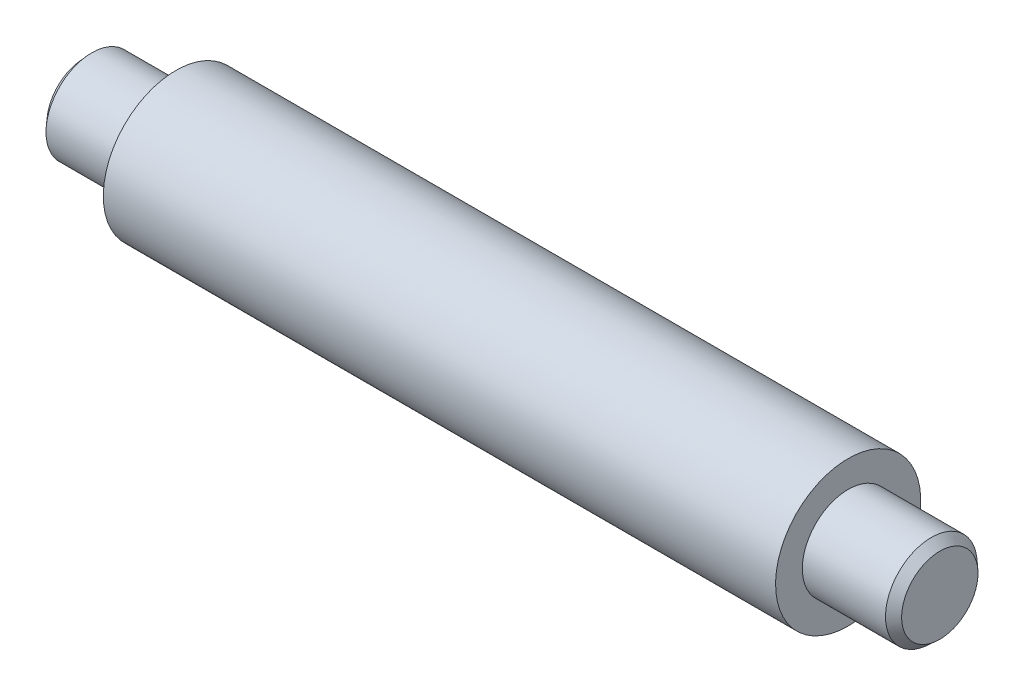
ISO-10303-21;
HEADER;
FILE_DESCRIPTION(('STEP AP214'),'2;1');
FILE_NAME('part.step','',(''),(''),'','','');
FILE_SCHEMA(('AUTOMOTIVE_DESIGN { 1 0 10303 214 1 1 1 1 }'));
ENDSEC;
DATA;
#1=APPLICATION_CONTEXT('core data for automotive mechanical design processes');
#2=APPLICATION_PROTOCOL_DEFINITION('international standard','automotive_design',2000,#1);
#3=PRODUCT_CONTEXT('',#1,'mechanical');
#4=PRODUCT('Part','Part','',(#3));
#5=PRODUCT_RELATED_PRODUCT_CATEGORY('part','',(#4));
#6=PRODUCT_DEFINITION_FORMATION('','',#4);
#7=PRODUCT_DEFINITION_CONTEXT('part definition',#1,'design');
#8=PRODUCT_DEFINITION('design','',#6,#7);
#9=PRODUCT_DEFINITION_SHAPE('','',#8);
#10=(LENGTH_UNIT() NAMED_UNIT(*) SI_UNIT(.MILLI.,.METRE.));
#11=(NAMED_UNIT(*) PLANE_ANGLE_UNIT() SI_UNIT($,.RADIAN.));
#12=(NAMED_UNIT(*) SI_UNIT($,.STERADIAN.) SOLID_ANGLE_UNIT());
#13=UNCERTAINTY_MEASURE_WITH_UNIT(LENGTH_MEASURE(1.E-05),#10,'distance_accuracy_value','');
#14=(GEOMETRIC_REPRESENTATION_CONTEXT(3) GLOBAL_UNCERTAINTY_ASSIGNED_CONTEXT((#13)) GLOBAL_UNIT_ASSIGNED_CONTEXT((#10,
#11,#12)) REPRESENTATION_CONTEXT('',''));
#15=CARTESIAN_POINT('',(0.,0.,0.));
#16=DIRECTION('',(0.,0.,1.));
#17=DIRECTION('',(1.,0.,0.));
#18=AXIS2_PLACEMENT_3D('',#15,#16,#17);
#19=CARTESIAN_POINT('',(60.,60.,0.));
#20=DIRECTION('',(1.,0.,0.));
#21=DIRECTION('',(0.,1.,0.));
#22=AXIS2_PLACEMENT_3D('',#19,#20,#21);
#23=PLANE('',#22);
#24=CARTESIAN_POINT('',(60.,30.,0.));
#25=DIRECTION('',(-1.,0.,0.));
#26=DIRECTION('',(0.,-1.,0.));
#27=AXIS2_PLACEMENT_3D('',#24,#25,#26);
#28=CIRCLE('',#27,30.);
#29=CARTESIAN_POINT('',(60.,0.,0.));
#30=VERTEX_POINT('',#29);
#31=EDGE_CURVE('E60',#30,#30,#28,.T.);
#32=ORIENTED_EDGE('',*,*,#31,.F.);
#33=EDGE_LOOP('',(#32));
#34=FACE_BOUND('',#33,.T.);
#35=CARTESIAN_POINT('',(60.,30.,0.));
#36=DIRECTION('',(-1.,0.,0.));
#37=DIRECTION('',(0.,-1.,0.));
#38=AXIS2_PLACEMENT_3D('',#35,#36,#37);
#39=CIRCLE('',#38,47.5);
#40=CARTESIAN_POINT('',(60.,-17.5,0.));
#41=VERTEX_POINT('',#40);
#42=EDGE_CURVE('E51',#41,#41,#39,.T.);
#43=ORIENTED_EDGE('',*,*,#42,.T.);
#44=EDGE_LOOP('',(#43));
#45=FACE_BOUND('',#44,.T.);
#46=ADVANCED_FACE('F31',(#34,#45),#23,.F.);
#47=CARTESIAN_POINT('',(0.,30.,0.));
#48=DIRECTION('',(-1.,0.,0.));
#49=DIRECTION('',(0.,-1.,0.));
#50=AXIS2_PLACEMENT_3D('',#47,#48,#49);
#51=CYLINDRICAL_SURFACE('',#50,47.4999999999999);
#52=ORIENTED_EDGE('',*,*,#42,.F.);
#53=EDGE_LOOP('',(#52));
#54=FACE_BOUND('',#53,.T.);
#55=CARTESIAN_POINT('',(500.,30.0000000000002,0.));
#56=DIRECTION('',(-1.,0.,0.));
#57=DIRECTION('',(0.,-1.,0.));
#58=AXIS2_PLACEMENT_3D('',#55,#56,#57);
#59=CIRCLE('',#58,47.4999999999998);
#60=CARTESIAN_POINT('',(500.,-17.4999999999996,0.));
#61=VERTEX_POINT('',#60);
#62=EDGE_CURVE('E54',#61,#61,#59,.T.);
#63=ORIENTED_EDGE('',*,*,#62,.T.);
#64=EDGE_LOOP('',(#63));
#65=FACE_BOUND('',#64,.T.);
#66=ADVANCED_FACE('F68',(#54,#65),#51,.T.);
#67=CARTESIAN_POINT('',(500.,60.0000000000002,0.));
#68=DIRECTION('',(-1.,0.,0.));
#69=DIRECTION('',(0.,-1.,0.));
#70=AXIS2_PLACEMENT_3D('',#67,#68,#69);
#71=PLANE('',#70);
#72=ORIENTED_EDGE('',*,*,#62,.F.);
#73=EDGE_LOOP('',(#72));
#74=FACE_BOUND('',#73,.T.);
#75=CARTESIAN_POINT('',(500.,30.0000000000002,0.));
#76=DIRECTION('',(-1.,0.,0.));
#77=DIRECTION('',(0.,-1.,0.));
#78=AXIS2_PLACEMENT_3D('',#75,#76,#77);
#79=CIRCLE('',#78,30.);
#80=CARTESIAN_POINT('',(500.,1.59594559789866E-13,0.));
#81=VERTEX_POINT('',#80);
#82=EDGE_CURVE('E57',#81,#81,#79,.T.);
#83=ORIENTED_EDGE('',*,*,#82,.T.);
#84=EDGE_LOOP('',(#83));
#85=FACE_BOUND('',#84,.T.);
#86=ADVANCED_FACE('F74',(#74,#85),#71,.F.);
#87=CARTESIAN_POINT('',(0.,30.,0.));
#88=DIRECTION('',(-1.,0.,0.));
#89=DIRECTION('',(0.,-1.,0.));
#90=AXIS2_PLACEMENT_3D('',#87,#88,#89);
#91=CYLINDRICAL_SURFACE('',#90,30.);
#92=CARTESIAN_POINT('',(554.446937425854,30.0000000000002,0.));
#93=DIRECTION('',(-1.,0.,0.));
#94=DIRECTION('',(0.,-1.,0.));
#95=AXIS2_PLACEMENT_3D('',#92,#93,#94);
#96=CIRCLE('',#95,30.);
#97=CARTESIAN_POINT('',(554.446937425854,1.80411241501588E-13,0.));
#98=VERTEX_POINT('',#97);
#99=EDGE_CURVE('E46',#98,#98,#96,.T.);
#100=ORIENTED_EDGE('',*,*,#99,.T.);
#101=EDGE_LOOP('',(#100));
#102=FACE_BOUND('',#101,.T.);
#103=ORIENTED_EDGE('',*,*,#82,.F.);
#104=EDGE_LOOP('',(#103));
#105=FACE_BOUND('',#104,.T.);
#106=ADVANCED_FACE('F80',(#102,#105),#91,.T.);
#107=CARTESIAN_POINT('',(560.,30.0000000000002,0.));
#108=DIRECTION('',(-1.,0.,0.));
#109=DIRECTION('',(0.,-1.,0.));
#110=AXIS2_PLACEMENT_3D('',#107,#108,#109);
#111=PLANE('',#110);
#112=CARTESIAN_POINT('',(560.,30.0000000000002,0.));
#113=DIRECTION('',(-1.,0.,0.));
#114=DIRECTION('',(0.,-1.,0.));
#115=AXIS2_PLACEMENT_3D('',#112,#113,#114);
#116=CIRCLE('',#115,24.9999999999999);
#117=CARTESIAN_POINT('',(560.,5.00000000000028,0.));
#118=VERTEX_POINT('',#117);
#119=EDGE_CURVE('E42',#118,#118,#116,.F.);
#120=ORIENTED_EDGE('',*,*,#119,.T.);
#121=EDGE_LOOP('',(#120));
#122=FACE_BOUND('',#121,.T.);
#123=ADVANCED_FACE('F85',(#122),#111,.F.);
#124=CARTESIAN_POINT('',(0.,30.,0.));
#125=DIRECTION('',(1.,0.,0.));
#126=DIRECTION('',(0.,1.,0.));
#127=AXIS2_PLACEMENT_3D('',#124,#125,#126);
#128=PLANE('',#127);
#129=CARTESIAN_POINT('',(0.,30.,0.));
#130=DIRECTION('',(1.,0.,0.));
#131=DIRECTION('',(0.,1.,0.));
#132=AXIS2_PLACEMENT_3D('',#129,#130,#131);
#133=CIRCLE('',#132,24.4469374258539);
#134=CARTESIAN_POINT('',(0.,54.4469374258539,0.));
#135=VERTEX_POINT('',#134);
#136=EDGE_CURVE('E38',#135,#135,#133,.F.);
#137=ORIENTED_EDGE('',*,*,#136,.T.);
#138=EDGE_LOOP('',(#137));
#139=FACE_BOUND('',#138,.T.);
#140=ADVANCED_FACE('F91',(#139),#128,.F.);
#141=CARTESIAN_POINT('',(0.,30.,0.));
#142=DIRECTION('',(-1.,0.,0.));
#143=DIRECTION('',(0.,-1.,0.));
#144=AXIS2_PLACEMENT_3D('',#141,#142,#143);
#145=CYLINDRICAL_SURFACE('',#144,30.);
#146=CARTESIAN_POINT('',(5.0000000000001,30.,0.));
#147=DIRECTION('',(1.,0.,0.));
#148=DIRECTION('',(0.,1.,0.));
#149=AXIS2_PLACEMENT_3D('',#146,#147,#148);
#150=CIRCLE('',#149,30.);
#151=CARTESIAN_POINT('',(5.00000000000008,60.,0.));
#152=VERTEX_POINT('',#151);
#153=EDGE_CURVE('E10',#152,#152,#150,.T.);
#154=ORIENTED_EDGE('',*,*,#153,.T.);
#155=EDGE_LOOP('',(#154));
#156=FACE_BOUND('',#155,.T.);
#157=ORIENTED_EDGE('',*,*,#31,.T.);
#158=EDGE_LOOP('',(#157));
#159=FACE_BOUND('',#158,.T.);
#160=ADVANCED_FACE('F64',(#156,#159),#145,.T.);
#161=CARTESIAN_POINT('',(554.446937425854,30.0000000000002,0.));
#162=DIRECTION('',(-1.,0.,0.));
#163=DIRECTION('',(0.,-1.,0.));
#164=AXIS2_PLACEMENT_3D('',#161,#162,#163);
#165=CONICAL_SURFACE('',#164,30.,0.733038285837615);
#166=ORIENTED_EDGE('',*,*,#119,.F.);
#167=EDGE_LOOP('',(#166));
#168=FACE_BOUND('',#167,.T.);
#169=ORIENTED_EDGE('',*,*,#99,.F.);
#170=EDGE_LOOP('',(#169));
#171=FACE_BOUND('',#170,.T.);
#172=ADVANCED_FACE('F95',(#168,#171),#165,.T.);
#173=CARTESIAN_POINT('',(0.,30.,0.));
#174=DIRECTION('',(1.,0.,0.));
#175=DIRECTION('',(0.,1.,0.));
#176=AXIS2_PLACEMENT_3D('',#173,#174,#175);
#177=CONICAL_SURFACE('',#176,24.4469374258539,0.837758040957279);
#178=ORIENTED_EDGE('',*,*,#153,.F.);
#179=EDGE_LOOP('',(#178));
#180=FACE_BOUND('',#179,.T.);
#181=ORIENTED_EDGE('',*,*,#136,.F.);
#182=EDGE_LOOP('',(#181));
#183=FACE_BOUND('',#182,.T.);
#184=ADVANCED_FACE('F33',(#180,#183),#177,.T.);
#185=CLOSED_SHELL('',(#46,#66,#86,#106,#123,#140,#160,#172,#184));
#186=MANIFOLD_SOLID_BREP('B2',#185);
#187=ADVANCED_BREP_SHAPE_REPRESENTATION('',(#18,#186),#14);
#188=SHAPE_DEFINITION_REPRESENTATION(#9,#187);
ENDSEC;
END-ISO-10303-21;
